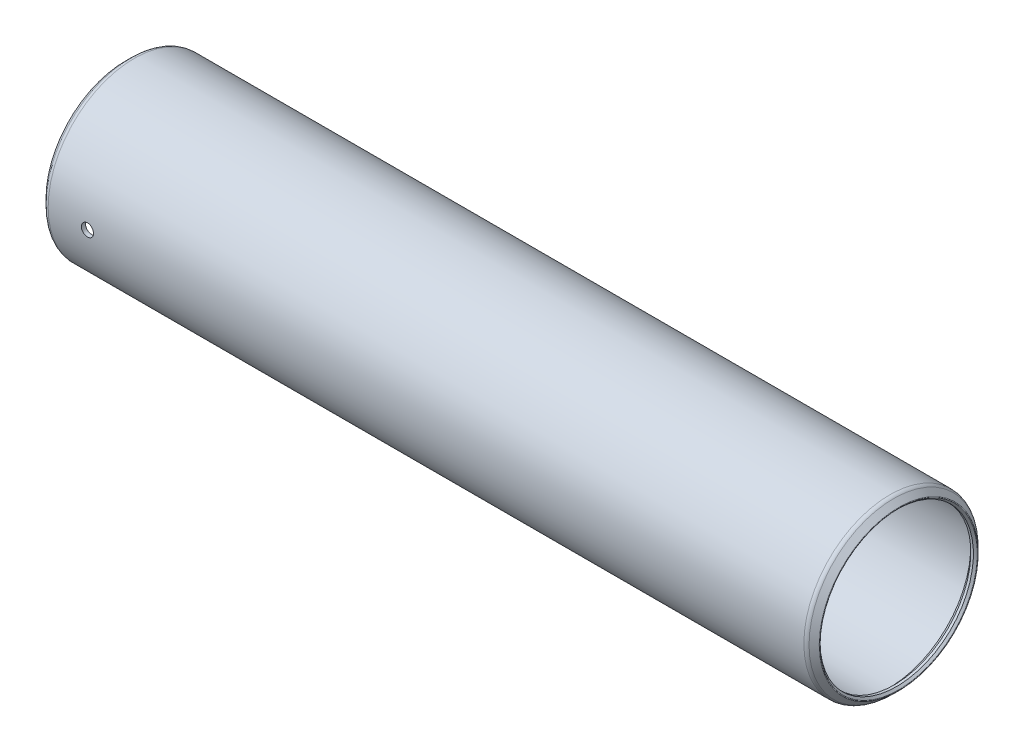
ISO-10303-21;
HEADER;
FILE_DESCRIPTION(('STEP AP214'),'2;1');
FILE_NAME('part.step','',(''),(''),'','','');
FILE_SCHEMA(('AUTOMOTIVE_DESIGN { 1 0 10303 214 1 1 1 1 }'));
ENDSEC;
DATA;
#1=APPLICATION_CONTEXT('core data for automotive mechanical design processes');
#2=APPLICATION_PROTOCOL_DEFINITION('international standard','automotive_design',2000,#1);
#3=PRODUCT_CONTEXT('',#1,'mechanical');
#4=PRODUCT('Part','Part','',(#3));
#5=PRODUCT_RELATED_PRODUCT_CATEGORY('part','',(#4));
#6=PRODUCT_DEFINITION_FORMATION('','',#4);
#7=PRODUCT_DEFINITION_CONTEXT('part definition',#1,'design');
#8=PRODUCT_DEFINITION('design','',#6,#7);
#9=PRODUCT_DEFINITION_SHAPE('','',#8);
#10=(LENGTH_UNIT() NAMED_UNIT(*) SI_UNIT(.MILLI.,.METRE.));
#11=(NAMED_UNIT(*) PLANE_ANGLE_UNIT() SI_UNIT($,.RADIAN.));
#12=(NAMED_UNIT(*) SI_UNIT($,.STERADIAN.) SOLID_ANGLE_UNIT());
#13=UNCERTAINTY_MEASURE_WITH_UNIT(LENGTH_MEASURE(1.E-05),#10,'distance_accuracy_value','');
#14=(GEOMETRIC_REPRESENTATION_CONTEXT(3) GLOBAL_UNCERTAINTY_ASSIGNED_CONTEXT((#13)) GLOBAL_UNIT_ASSIGNED_CONTEXT((#10,
#11,#12)) REPRESENTATION_CONTEXT('',''));
#15=CARTESIAN_POINT('',(0.,0.,0.));
#16=DIRECTION('',(0.,0.,1.));
#17=DIRECTION('',(1.,0.,0.));
#18=AXIS2_PLACEMENT_3D('',#15,#16,#17);
#19=CARTESIAN_POINT('',(149.5552,0.,0.));
#20=DIRECTION('',(-1.,0.,0.));
#21=DIRECTION('',(0.,0.,1.));
#22=AXIS2_PLACEMENT_3D('',#19,#20,#21);
#23=CYLINDRICAL_SURFACE('',#22,16.02105);
#24=CARTESIAN_POINT('',(1.01599999999999,0.,0.));
#25=DIRECTION('',(-1.,0.,0.));
#26=DIRECTION('',(0.,0.,1.));
#27=AXIS2_PLACEMENT_3D('',#24,#25,#26);
#28=CIRCLE('',#27,16.02105);
#29=CARTESIAN_POINT('',(1.01599999999999,0.,16.02105));
#30=VERTEX_POINT('',#29);
#31=EDGE_CURVE('E57',#30,#30,#28,.T.);
#32=ORIENTED_EDGE('',*,*,#31,.T.);
#33=EDGE_LOOP('',(#32));
#34=FACE_BOUND('',#33,.T.);
#35=CARTESIAN_POINT('',(148.5392,0.,0.));
#36=DIRECTION('',(-1.,0.,0.));
#37=DIRECTION('',(0.,0.,1.));
#38=AXIS2_PLACEMENT_3D('',#35,#36,#37);
#39=CIRCLE('',#38,16.02105);
#40=CARTESIAN_POINT('',(148.5392,0.,16.02105));
#41=VERTEX_POINT('',#40);
#42=EDGE_CURVE('E60',#41,#41,#39,.T.);
#43=ORIENTED_EDGE('',*,*,#42,.F.);
#44=EDGE_LOOP('',(#43));
#45=FACE_BOUND('',#44,.T.);
#46=CARTESIAN_POINT('',(9.70279999999999,0.,16.02105));
#47=CARTESIAN_POINT('',(9.70279706520824,-0.0669566152777428,16.0210494133005));
#48=CARTESIAN_POINT('',(9.69714797089088,-0.133959408495349,16.0206257720828));
#49=CARTESIAN_POINT('',(9.67469483321733,-0.266112872885107,16.0189765133516));
#50=CARTESIAN_POINT('',(9.65787799368977,-0.331261329925711,16.0177499758904));
#51=CARTESIAN_POINT('',(9.61357685930651,-0.457772882834231,16.014633597949));
#52=CARTESIAN_POINT('',(9.58609841354014,-0.51913803291572,16.0127441212197));
#53=CARTESIAN_POINT('',(9.52126410536775,-0.636369658290597,16.0085140424356));
#54=CARTESIAN_POINT('',(9.48391042401329,-0.692237344023746,16.0061735400256));
#55=CARTESIAN_POINT('',(9.40030214102438,-0.79701899259515,16.0012988375443));
#56=CARTESIAN_POINT('',(9.35403137567909,-0.845920042926816,15.998764290842));
#57=CARTESIAN_POINT('',(9.25393625477573,-0.935269642121525,15.9937900885991));
#58=CARTESIAN_POINT('',(9.2001115751218,-0.975717828134388,15.9913504371357));
#59=CARTESIAN_POINT('',(9.08636013621567,-1.04705583277077,15.9868383661694));
#60=CARTESIAN_POINT('',(9.02642638212852,-1.07793452726745,15.9847663752428));
#61=CARTESIAN_POINT('',(8.90220696446403,-1.12918591984865,15.9812279272536));
#62=CARTESIAN_POINT('',(8.8379213639444,-1.14955877012468,15.9797614614194));
#63=CARTESIAN_POINT('',(8.70695074157336,-1.17918328521173,15.9776028360577));
#64=CARTESIAN_POINT('',(8.64027043890182,-1.18845570661457,15.9769092315327));
#65=CARTESIAN_POINT('',(8.5062965410256,-1.19568025672226,15.9763702265494));
#66=CARTESIAN_POINT('',(8.43900295525313,-1.1936325592369,15.976524813068));
#67=CARTESIAN_POINT('',(8.30585457888071,-1.1782921804781,15.9776634170375));
#68=CARTESIAN_POINT('',(8.23999717835317,-1.16502201190737,15.9786457739354));
#69=CARTESIAN_POINT('',(8.11144715928859,-1.12764833268643,15.9813266150936));
#70=CARTESIAN_POINT('',(8.04875456621335,-1.10354473489361,15.9830251051143));
#71=CARTESIAN_POINT('',(7.92824175757535,-1.04516304205303,15.9869487342801));
#72=CARTESIAN_POINT('',(7.87042647774632,-1.01087479526701,15.9891743984454));
#73=CARTESIAN_POINT('',(7.76136342516126,-0.933104455322872,15.9939010804274));
#74=CARTESIAN_POINT('',(7.7101157583576,-0.889622213872113,15.996402102685));
#75=CARTESIAN_POINT('',(7.61551172816844,-0.794571676950297,16.001405061793));
#76=CARTESIAN_POINT('',(7.57217492548818,-0.742983909593353,16.0039069859837));
#77=CARTESIAN_POINT('',(7.49477386998589,-0.633254789658335,16.0086239894766));
#78=CARTESIAN_POINT('',(7.46070962185451,-0.575113433765067,16.0108390686336));
#79=CARTESIAN_POINT('',(7.40282205145223,-0.453915229240835,16.0147330951866));
#80=CARTESIAN_POINT('',(7.37899953805438,-0.390857992827259,16.0164120002339));
#81=CARTESIAN_POINT('',(7.34228507708127,-0.261623578508758,16.0190439854347));
#82=CARTESIAN_POINT('',(7.32939294813818,-0.195446452391385,16.0199970776318));
#83=CARTESIAN_POINT('',(7.31492960923661,-0.0620204076045535,16.0210684985366));
#84=CARTESIAN_POINT('',(7.31333136891893,0.00522556567420777,16.0211888203509));
#85=CARTESIAN_POINT('',(7.32143044956756,0.139029521504403,16.0205864563069));
#86=CARTESIAN_POINT('',(7.33112768656339,0.205587509166606,16.0198637767156));
#87=CARTESIAN_POINT('',(7.3615200595147,0.336049510123086,16.0176580024258));
#88=CARTESIAN_POINT('',(7.38220272478208,0.399956444390026,16.016175770041));
#89=CARTESIAN_POINT('',(7.43396614581833,0.523392589080339,16.0126175099669));
#90=CARTESIAN_POINT('',(7.46504703382642,0.582921743817638,16.010541474726));
#91=CARTESIAN_POINT('',(7.5367929603938,0.696035881380302,16.006023610124));
#92=CARTESIAN_POINT('',(7.57747597302289,0.749609435942374,16.0035810979225));
#93=CARTESIAN_POINT('',(7.66724525322349,0.849176400421608,15.9986072063538));
#94=CARTESIAN_POINT('',(7.71633163764561,0.895169704916369,15.9960758257513));
#95=CARTESIAN_POINT('',(7.82163126812709,0.978362781285479,15.9912036531407));
#96=CARTESIAN_POINT('',(7.87785843333551,1.01554496113354,15.9888632484336));
#97=CARTESIAN_POINT('',(7.9957739567659,1.07993983561797,15.9846432199179));
#98=CARTESIAN_POINT('',(8.05746226991206,1.10715261253133,15.9827635923065));
#99=CARTESIAN_POINT('',(8.18448579496939,1.15080601392083,15.97967991949));
#100=CARTESIAN_POINT('',(8.2498172410541,1.16725754600383,15.9784751903857));
#101=CARTESIAN_POINT('',(8.38232441499383,1.18895702368358,15.9768753055686));
#102=CARTESIAN_POINT('',(8.44950011528954,1.1942051366046,15.976480137765));
#103=CARTESIAN_POINT('',(8.58361407368,1.19334702986037,15.976544242776));
#104=CARTESIAN_POINT('',(8.65055251140766,1.18726845700228,15.9770014351036));
#105=CARTESIAN_POINT('',(8.78245520900734,1.16398702720102,15.9787143300673));
#106=CARTESIAN_POINT('',(8.84741946558123,1.14678415167422,15.9799700340373));
#107=CARTESIAN_POINT('',(8.97353251663077,1.10174912009622,15.9831379271101));
#108=CARTESIAN_POINT('',(9.03468143187387,1.07391730068302,15.9850500954212));
#109=CARTESIAN_POINT('',(9.15144291334917,1.00841775259181,15.9893154673754));
#110=CARTESIAN_POINT('',(9.20705559222398,0.970750224091844,15.9916686620422));
#111=CARTESIAN_POINT('',(9.3113070802482,0.886545023273679,15.9965577151813));
#112=CARTESIAN_POINT('',(9.35992945510258,0.839987028367214,15.9990939837127));
#113=CARTESIAN_POINT('',(9.448687277448,0.739356340582741,16.0040597191709));
#114=CARTESIAN_POINT('',(9.48882065829193,0.685281823103509,16.0064891599766));
#115=CARTESIAN_POINT('',(9.55950378441263,0.571068619367323,16.0109710137583));
#116=CARTESIAN_POINT('',(9.59003836690499,0.510920534998868,16.0130228281169));
#117=CARTESIAN_POINT('',(9.64053675717511,0.386378243366696,16.0165108455186));
#118=CARTESIAN_POINT('',(9.66051282111822,0.321989057224918,16.017947761955));
#119=CARTESIAN_POINT('',(9.68419163843129,0.214344538732717,16.019671676354));
#120=CARTESIAN_POINT('',(9.69116061501202,0.171783170918517,16.0201862204269));
#121=CARTESIAN_POINT('',(9.70046573532017,0.0861542420497312,16.0208755706727));
#122=CARTESIAN_POINT('',(9.70280188854287,0.0430866820328002,16.021050377542));
#123=CARTESIAN_POINT('',(9.70279999999999,0.,16.02105));
#124=B_SPLINE_CURVE_WITH_KNOTS('',3,(#46,#47,#48,#49,#50,#51,#52,#53,#54,#55,#56,#57,#58,#59,
#60,#61,#62,#63,#64,#65,#66,#67,#68,#69,#70,#71,#72,#73,#74,#75,#76,#77,#78,#79,#80,#81,#82,#83,
#84,#85,#86,#87,#88,#89,#90,#91,#92,#93,#94,#95,#96,#97,#98,#99,#100,#101,#102,#103,#104,#105,
#106,#107,#108,#109,#110,#111,#112,#113,#114,#115,#116,#117,#118,#119,#120,#121,#122,#123),
.UNSPECIFIED.,.T.,.F.,(4,2,2,2,2,2,2,2,2,2,2,2,2,2,2,2,2,2,2,2,2,2,2,2,2,2,2,2,2,2,2,2,2,2,2,2,
2,2,4),(0.,0.200712542338555,0.401655461870689,0.602488297146018,0.803276813340697,
1.00443277528007,1.20559737032749,1.40699494102528,1.60838959412219,1.80940707000623,
2.01042145946402,2.21103356033869,2.41164727493845,2.61246162989096,2.81327922408424,
3.01458683335453,3.21589454445865,3.41721815154992,3.61853841801394,3.81937668858916,
4.02021346614387,4.22082273899873,4.42143456319521,4.62242493023976,4.82341809232393,
5.02480923250325,5.22619871057404,5.42738374248099,5.62856576964668,5.82925738360845,
6.02994933283515,6.23063492630964,6.43131643571468,6.63246229374364,6.83365706454966,
7.03516807483583,7.23644465768051,7.3656037434647,7.4947625645291),.UNSPECIFIED.);
#125=CARTESIAN_POINT('',(9.70279999999999,0.,16.02105));
#126=VERTEX_POINT('',#125);
#127=EDGE_CURVE('E90',#126,#126,#124,.T.);
#128=ORIENTED_EDGE('',*,*,#127,.F.);
#129=EDGE_LOOP('',(#128));
#130=FACE_BOUND('',#129,.T.);
#131=ADVANCED_FACE('F33',(#34,#45,#130),#23,.F.);
#132=CARTESIAN_POINT('',(149.5552,0.,0.));
#133=DIRECTION('',(-1.,0.,0.));
#134=DIRECTION('',(0.,0.,1.));
#135=AXIS2_PLACEMENT_3D('',#132,#133,#134);
#136=CYLINDRICAL_SURFACE('',#135,16.8465499999996);
#137=CARTESIAN_POINT('',(0.825500000002949,0.,0.));
#138=DIRECTION('',(-1.,0.,0.));
#139=DIRECTION('',(0.,0.,1.));
#140=AXIS2_PLACEMENT_3D('',#137,#138,#139);
#141=CIRCLE('',#140,16.8465499999996);
#142=CARTESIAN_POINT('',(0.825500000002949,0.,16.8465499999996));
#143=VERTEX_POINT('',#142);
#144=EDGE_CURVE('E81',#143,#143,#141,.T.);
#145=ORIENTED_EDGE('',*,*,#144,.F.);
#146=EDGE_LOOP('',(#145));
#147=FACE_BOUND('',#146,.T.);
#148=CARTESIAN_POINT('',(148.729699999988,0.,0.));
#149=DIRECTION('',(-1.,0.,0.));
#150=DIRECTION('',(0.,0.,1.));
#151=AXIS2_PLACEMENT_3D('',#148,#149,#150);
#152=CIRCLE('',#151,16.8465499999997);
#153=CARTESIAN_POINT('',(148.729699999988,0.,16.8465499999997));
#154=VERTEX_POINT('',#153);
#155=EDGE_CURVE('E78',#154,#154,#152,.T.);
#156=ORIENTED_EDGE('',*,*,#155,.T.);
#157=EDGE_LOOP('',(#156));
#158=FACE_BOUND('',#157,.T.);
#159=CARTESIAN_POINT('',(7.3152,0.,16.8465499999996));
#160=CARTESIAN_POINT('',(7.31520293895514,-0.0669661238267227,16.8465494406307));
#161=CARTESIAN_POINT('',(7.32085363115716,-0.133978659531247,16.8461464427668));
#162=CARTESIAN_POINT('',(7.34331348633926,-0.26615199183264,16.8445775491741));
#163=CARTESIAN_POINT('',(7.36013550992843,-0.331310563854439,16.8434107741954));
#164=CARTESIAN_POINT('',(7.40445121840721,-0.457842393718408,16.8404462677168));
#165=CARTESIAN_POINT('',(7.43193912337301,-0.519217680911849,16.8386488780024));
#166=CARTESIAN_POINT('',(7.49679657609811,-0.636467588698453,16.8346250817038));
#167=CARTESIAN_POINT('',(7.53416391576954,-0.692343434611112,16.832398771015));
#168=CARTESIAN_POINT('',(7.61779612843459,-0.797129175059421,16.827762532504));
#169=CARTESIAN_POINT('',(7.66407571961432,-0.846027310366122,16.8253523049829));
#170=CARTESIAN_POINT('',(7.76418801540135,-0.935368874599474,16.8206224207968));
#171=CARTESIAN_POINT('',(7.81802104126684,-0.975811943738018,16.8183027679896));
#172=CARTESIAN_POINT('',(7.93178084589773,-1.04713326343972,16.8140132437029));
#173=CARTESIAN_POINT('',(7.99171393014588,-1.07800148057492,16.8120437400586));
#174=CARTESIAN_POINT('',(8.11592847131427,-1.12923271696379,16.8086805949771));
#175=CARTESIAN_POINT('',(8.18020987047614,-1.14959587572444,16.8072869458925));
#176=CARTESIAN_POINT('',(8.31118085026105,-1.17920562719005,16.8052355890591));
#177=CARTESIAN_POINT('',(8.37786616610815,-1.18847099650881,16.8045766383877));
#178=CARTESIAN_POINT('',(8.51184852816102,-1.19568013971067,16.8040652707627));
#179=CARTESIAN_POINT('',(8.57914556575632,-1.1936240727064,16.8042128424742));
#180=CARTESIAN_POINT('',(8.71231284644801,-1.17826426174688,16.8052967246719));
#181=CARTESIAN_POINT('',(8.77818544998368,-1.16498086772801,16.8062316081159));
#182=CARTESIAN_POINT('',(8.90676365539148,-1.1275750532564,16.8087825219654));
#183=CARTESIAN_POINT('',(8.96946923387477,-1.10345255276871,16.8103985574004));
#184=CARTESIAN_POINT('',(9.08999859804903,-1.04503028840931,16.8141313141687));
#185=CARTESIAN_POINT('',(9.14781791263902,-1.01072133037981,16.8162484874708));
#186=CARTESIAN_POINT('',(9.25688458737119,-0.932906704113812,16.8207445065162));
#187=CARTESIAN_POINT('',(9.30813185184109,-0.889400902019159,16.823123356068));
#188=CARTESIAN_POINT('',(9.40271807563865,-0.794313118975004,16.8278810077325));
#189=CARTESIAN_POINT('',(9.44603933963433,-0.742713533480596,16.8302597981637));
#190=CARTESIAN_POINT('',(9.52340722059522,-0.632964511182586,16.8347442495045));
#191=CARTESIAN_POINT('',(9.55745383337556,-0.574815071423605,16.8368499102908));
#192=CARTESIAN_POINT('',(9.61530460226416,-0.453605972725415,16.8405510845206));
#193=CARTESIAN_POINT('',(9.63910804646987,-0.390545972860742,16.8421465625042));
#194=CARTESIAN_POINT('',(9.67578475724807,-0.261310766180427,16.8446471466386));
#195=CARTESIAN_POINT('',(9.68865818785402,-0.195135606131647,16.8455522631501));
#196=CARTESIAN_POINT('',(9.70308742052837,-0.0617020228476386,16.846568804951));
#197=CARTESIAN_POINT('',(9.7046676793737,0.00555374318701941,16.8466819453528));
#198=CARTESIAN_POINT('',(9.69652967369824,0.139374295202839,16.8461063553156));
#199=CARTESIAN_POINT('',(9.6868114850326,0.205939085820022,16.8454176302602));
#200=CARTESIAN_POINT('',(9.65637270574791,0.336418954054509,16.8433169165544));
#201=CARTESIAN_POINT('',(9.63566337832208,0.400336672111095,16.8419056683635));
#202=CARTESIAN_POINT('',(9.58384164556743,0.523789612436823,16.8385185899685));
#203=CARTESIAN_POINT('',(9.55272912034475,0.583324784188724,16.8365427532576));
#204=CARTESIAN_POINT('',(9.48092219665155,0.696434389011605,16.832244039473));
#205=CARTESIAN_POINT('',(9.44021151239705,0.749998460495226,16.8299205750338));
#206=CARTESIAN_POINT('',(9.35038753591807,0.84954096506295,16.8251899022617));
#207=CARTESIAN_POINT('',(9.30127413789388,0.895519302619714,16.8227826928747));
#208=CARTESIAN_POINT('',(9.19593313972062,0.978668415791489,16.8181508261354));
#209=CARTESIAN_POINT('',(9.1396929718388,1.01582329060936,16.8159265030072));
#210=CARTESIAN_POINT('',(9.02175782215754,1.08016192921223,16.8119166269556));
#211=CARTESIAN_POINT('',(8.96006288173553,1.10734576862492,16.8101310707043));
#212=CARTESIAN_POINT('',(8.8330269050688,1.15094331524486,16.8072025240016));
#213=CARTESIAN_POINT('',(8.76768928295928,1.16736692937402,16.8060589426243));
#214=CARTESIAN_POINT('',(8.63517546433297,1.18901013856214,16.8045416877017));
#215=CARTESIAN_POINT('',(8.56799929230868,1.1942298828015,16.8041680039052));
#216=CARTESIAN_POINT('',(8.43387331669439,1.19331565367433,16.8042329387475));
#217=CARTESIAN_POINT('',(8.36692334046323,1.18720667185156,16.8046697693659));
#218=CARTESIAN_POINT('',(8.2350024798505,1.16386032783146,16.8063027184883));
#219=CARTESIAN_POINT('',(8.17003159887269,1.14662294649599,16.8074988382982));
#220=CARTESIAN_POINT('',(8.04391029763654,1.10151502218121,16.810515131654));
#221=CARTESIAN_POINT('',(7.98275978996443,1.07364472259695,16.8123352909152));
#222=CARTESIAN_POINT('',(7.86600221301046,1.00806521548598,16.8163945594842));
#223=CARTESIAN_POINT('',(7.81039502105466,0.970356225757004,16.8186336595176));
#224=CARTESIAN_POINT('',(7.70617519281369,0.886076476377669,16.8232843181968));
#225=CARTESIAN_POINT('',(7.65757736792871,0.839487420712796,16.8256962263692));
#226=CARTESIAN_POINT('',(7.56887423002009,0.738799018132044,16.8304176242278));
#227=CARTESIAN_POINT('',(7.52877098903372,0.684697844141914,16.8327270888172));
#228=CARTESIAN_POINT('',(7.45815712427103,0.570443887369817,16.8369864063141));
#229=CARTESIAN_POINT('',(7.42766062021841,0.510282366948036,16.8389357281709));
#230=CARTESIAN_POINT('',(7.37723966712562,0.385721784425599,16.8422483990093));
#231=CARTESIAN_POINT('',(7.35730292038865,0.321327750153744,16.8436124292573));
#232=CARTESIAN_POINT('',(7.33371099532527,0.21378734127683,16.8452460392033));
#233=CARTESIAN_POINT('',(7.32677843945678,0.171334871697962,16.8457328320089));
#234=CARTESIAN_POINT('',(7.31752200301421,0.085927971687145,16.8463849915925));
#235=CARTESIAN_POINT('',(7.3151981140119,0.0429735421733137,16.8465503589582));
#236=CARTESIAN_POINT('',(7.3152,0.,16.8465499999996));
#237=B_SPLINE_CURVE_WITH_KNOTS('',3,(#159,#160,#161,#162,#163,#164,#165,#166,#167,#168,#169,
#170,#171,#172,#173,#174,#175,#176,#177,#178,#179,#180,#181,#182,#183,#184,#185,#186,#187,#188,
#189,#190,#191,#192,#193,#194,#195,#196,#197,#198,#199,#200,#201,#202,#203,#204,#205,#206,#207,
#208,#209,#210,#211,#212,#213,#214,#215,#216,#217,#218,#219,#220,#221,#222,#223,#224,#225,#226,
#227,#228,#229,#230,#231,#232,#233,#234,#235,#236),.UNSPECIFIED.,.T.,.F.,(4,2,2,2,2,2,2,2,2,2,2,
2,2,2,2,2,2,2,2,2,2,2,2,2,2,2,2,2,2,2,2,2,2,2,2,2,2,2,4),(0.,0.200741484787577,
0.401714467812576,0.602578693780055,0.803398063793514,1.00455196707638,1.20571442831206,
1.40708697981322,1.60845685702173,1.80948554829892,2.01051141430558,2.21117369310023,
2.41183745359064,2.61268288391973,2.81353123771374,3.01482266839095,3.21611418989387,
3.41741969894465,3.61872218682615,3.81958859649991,4.02045365761123,4.2211132781276,
4.42177521126835,4.62278010175055,4.82378752329926,5.02515447799147,5.22651990533652,
5.42769967434804,5.62887676461845,5.82961057943993,6.03034473947546,6.2310743048392,
6.43179942705711,6.63294267268444,6.83413492572357,7.03562152072881,7.23687294938195,
7.36569313406096,7.49451308315603),.UNSPECIFIED.);
#238=CARTESIAN_POINT('',(7.3152,0.,16.8465499999996));
#239=VERTEX_POINT('',#238);
#240=EDGE_CURVE('E10',#239,#239,#237,.T.);
#241=ORIENTED_EDGE('',*,*,#240,.F.);
#242=EDGE_LOOP('',(#241));
#243=FACE_BOUND('',#242,.T.);
#244=ADVANCED_FACE('F111',(#147,#158,#243),#136,.T.);
#245=CARTESIAN_POINT('',(-0.792815367264614,0.,0.));
#246=DIRECTION('',(-1.,0.,0.));
#247=DIRECTION('',(0.,0.,1.));
#248=AXIS2_PLACEMENT_3D('',#245,#246,#247);
#249=TOROIDAL_SURFACE('',#248,15.4694704896855,0.126999999999535);
#250=CARTESIAN_POINT('',(-0.882617928474827,0.,0.));
#251=DIRECTION('',(-1.,0.,0.));
#252=DIRECTION('',(0.,0.,1.));
#253=AXIS2_PLACEMENT_3D('',#250,#251,#252);
#254=CIRCLE('',#253,15.379667928475);
#255=CARTESIAN_POINT('',(-0.882617928474827,0.,15.379667928475));
#256=VERTEX_POINT('',#255);
#257=EDGE_CURVE('E44',#256,#256,#254,.T.);
#258=ORIENTED_EDGE('',*,*,#257,.F.);
#259=EDGE_LOOP('',(#258));
#260=FACE_BOUND('',#259,.T.);
#261=CARTESIAN_POINT('',(-0.882617928474827,0.,0.));
#262=DIRECTION('',(-1.,0.,0.));
#263=DIRECTION('',(0.,0.,1.));
#264=AXIS2_PLACEMENT_3D('',#261,#262,#263);
#265=CIRCLE('',#264,15.559273050896);
#266=CARTESIAN_POINT('',(-0.882617928474827,0.,15.559273050896));
#267=VERTEX_POINT('',#266);
#268=EDGE_CURVE('E87',#267,#267,#265,.T.);
#269=ORIENTED_EDGE('',*,*,#268,.T.);
#270=EDGE_LOOP('',(#269));
#271=FACE_BOUND('',#270,.T.);
#272=ADVANCED_FACE('F35',(#260,#271),#249,.T.);
#273=CARTESIAN_POINT('',(-0.882617928474827,0.,0.));
#274=DIRECTION('',(-1.,0.,0.));
#275=DIRECTION('',(0.,0.,1.));
#276=AXIS2_PLACEMENT_3D('',#273,#274,#275);
#277=CONICAL_SURFACE('',#276,15.379667928475,0.785398163397689);
#278=CARTESIAN_POINT('',(-0.508000000000008,0.,0.));
#279=DIRECTION('',(-1.,0.,0.));
#280=DIRECTION('',(0.,0.,1.));
#281=AXIS2_PLACEMENT_3D('',#278,#279,#280);
#282=CIRCLE('',#281,15.00505);
#283=CARTESIAN_POINT('',(-0.508000000000008,0.,15.00505));
#284=VERTEX_POINT('',#283);
#285=EDGE_CURVE('E48',#284,#284,#282,.T.);
#286=ORIENTED_EDGE('',*,*,#285,.F.);
#287=EDGE_LOOP('',(#286));
#288=FACE_BOUND('',#287,.T.);
#289=ORIENTED_EDGE('',*,*,#257,.T.);
#290=EDGE_LOOP('',(#289));
#291=FACE_BOUND('',#290,.T.);
#292=ADVANCED_FACE('F160',(#288,#291),#277,.F.);
#293=CARTESIAN_POINT('',(149.5552,0.,0.));
#294=DIRECTION('',(-1.,0.,0.));
#295=DIRECTION('',(0.,0.,1.));
#296=AXIS2_PLACEMENT_3D('',#293,#294,#295);
#297=CYLINDRICAL_SURFACE('',#296,15.00505);
#298=CARTESIAN_POINT('',(0.,0.,0.));
#299=DIRECTION('',(-1.,0.,0.));
#300=DIRECTION('',(0.,0.,1.));
#301=AXIS2_PLACEMENT_3D('',#298,#299,#300);
#302=CIRCLE('',#301,15.00505);
#303=CARTESIAN_POINT('',(0.,0.,15.00505));
#304=VERTEX_POINT('',#303);
#305=EDGE_CURVE('E52',#304,#304,#302,.T.);
#306=ORIENTED_EDGE('',*,*,#305,.F.);
#307=EDGE_LOOP('',(#306));
#308=FACE_BOUND('',#307,.T.);
#309=ORIENTED_EDGE('',*,*,#285,.T.);
#310=EDGE_LOOP('',(#309));
#311=FACE_BOUND('',#310,.T.);
#312=ADVANCED_FACE('F141',(#308,#311),#297,.F.);
#313=CARTESIAN_POINT('',(0.,0.,0.));
#314=DIRECTION('',(1.,0.,0.));
#315=DIRECTION('',(0.,0.,-1.));
#316=AXIS2_PLACEMENT_3D('',#313,#314,#315);
#317=CONICAL_SURFACE('',#316,15.00505,0.785398163397453);
#318=ORIENTED_EDGE('',*,*,#31,.F.);
#319=EDGE_LOOP('',(#318));
#320=FACE_BOUND('',#319,.T.);
#321=ORIENTED_EDGE('',*,*,#305,.T.);
#322=EDGE_LOOP('',(#321));
#323=FACE_BOUND('',#322,.T.);
#324=ADVANCED_FACE('F136',(#320,#323),#317,.F.);
#325=CARTESIAN_POINT('',(148.5392,0.,0.));
#326=DIRECTION('',(-1.,0.,0.));
#327=DIRECTION('',(0.,0.,1.));
#328=AXIS2_PLACEMENT_3D('',#325,#326,#327);
#329=CONICAL_SURFACE('',#328,16.02105,0.785398163397439);
#330=CARTESIAN_POINT('',(149.5552,0.,0.));
#331=DIRECTION('',(-1.,0.,0.));
#332=DIRECTION('',(0.,0.,1.));
#333=AXIS2_PLACEMENT_3D('',#330,#331,#332);
#334=CIRCLE('',#333,15.00505);
#335=CARTESIAN_POINT('',(149.5552,0.,15.00505));
#336=VERTEX_POINT('',#335);
#337=EDGE_CURVE('E63',#336,#336,#334,.T.);
#338=ORIENTED_EDGE('',*,*,#337,.F.);
#339=EDGE_LOOP('',(#338));
#340=FACE_BOUND('',#339,.T.);
#341=ORIENTED_EDGE('',*,*,#42,.T.);
#342=EDGE_LOOP('',(#341));
#343=FACE_BOUND('',#342,.T.);
#344=ADVANCED_FACE('F133',(#340,#343),#329,.F.);
#345=CARTESIAN_POINT('',(149.5552,0.,0.));
#346=DIRECTION('',(-1.,0.,0.));
#347=DIRECTION('',(0.,0.,1.));
#348=AXIS2_PLACEMENT_3D('',#345,#346,#347);
#349=CYLINDRICAL_SURFACE('',#348,15.00505);
#350=CARTESIAN_POINT('',(150.0632,0.,0.));
#351=DIRECTION('',(-1.,0.,0.));
#352=DIRECTION('',(0.,0.,1.));
#353=AXIS2_PLACEMENT_3D('',#350,#351,#352);
#354=CIRCLE('',#353,15.00505);
#355=CARTESIAN_POINT('',(150.0632,0.,15.00505));
#356=VERTEX_POINT('',#355);
#357=EDGE_CURVE('E66',#356,#356,#354,.T.);
#358=ORIENTED_EDGE('',*,*,#357,.F.);
#359=EDGE_LOOP('',(#358));
#360=FACE_BOUND('',#359,.T.);
#361=ORIENTED_EDGE('',*,*,#337,.T.);
#362=EDGE_LOOP('',(#361));
#363=FACE_BOUND('',#362,.T.);
#364=ADVANCED_FACE('F130',(#360,#363),#349,.F.);
#365=CARTESIAN_POINT('',(150.0632,0.,0.));
#366=DIRECTION('',(1.,0.,0.));
#367=DIRECTION('',(0.,0.,-1.));
#368=AXIS2_PLACEMENT_3D('',#365,#366,#367);
#369=CONICAL_SURFACE('',#368,15.00505,0.785398163397442);
#370=CARTESIAN_POINT('',(150.437817928479,0.,0.));
#371=DIRECTION('',(-1.,0.,0.));
#372=DIRECTION('',(0.,0.,1.));
#373=AXIS2_PLACEMENT_3D('',#370,#371,#372);
#374=CIRCLE('',#373,15.3796679284786);
#375=CARTESIAN_POINT('',(150.437817928479,0.,15.3796679284786));
#376=VERTEX_POINT('',#375);
#377=EDGE_CURVE('E69',#376,#376,#374,.T.);
#378=ORIENTED_EDGE('',*,*,#377,.F.);
#379=EDGE_LOOP('',(#378));
#380=FACE_BOUND('',#379,.T.);
#381=ORIENTED_EDGE('',*,*,#357,.T.);
#382=EDGE_LOOP('',(#381));
#383=FACE_BOUND('',#382,.T.);
#384=ADVANCED_FACE('F126',(#380,#383),#369,.F.);
#385=CARTESIAN_POINT('',(150.348015367269,0.,0.));
#386=DIRECTION('',(-1.,0.,0.));
#387=DIRECTION('',(0.,0.,1.));
#388=AXIS2_PLACEMENT_3D('',#385,#386,#387);
#389=TOROIDAL_SURFACE('',#388,15.4694704896879,0.126999999997907);
#390=CARTESIAN_POINT('',(150.437817928479,0.,0.));
#391=DIRECTION('',(-1.,0.,0.));
#392=DIRECTION('',(0.,0.,1.));
#393=AXIS2_PLACEMENT_3D('',#390,#391,#392);
#394=CIRCLE('',#393,15.5592730508971);
#395=CARTESIAN_POINT('',(150.437817928479,0.,15.5592730508971));
#396=VERTEX_POINT('',#395);
#397=EDGE_CURVE('E72',#396,#396,#394,.T.);
#398=ORIENTED_EDGE('',*,*,#397,.F.);
#399=EDGE_LOOP('',(#398));
#400=FACE_BOUND('',#399,.T.);
#401=ORIENTED_EDGE('',*,*,#377,.T.);
#402=EDGE_LOOP('',(#401));
#403=FACE_BOUND('',#402,.T.);
#404=ADVANCED_FACE('F122',(#400,#403),#389,.T.);
#405=CARTESIAN_POINT('',(150.437817928479,0.,0.));
#406=DIRECTION('',(-1.,0.,0.));
#407=DIRECTION('',(0.,0.,1.));
#408=AXIS2_PLACEMENT_3D('',#405,#406,#407);
#409=CONICAL_SURFACE('',#408,15.5592730508971,0.785398163397411);
#410=CARTESIAN_POINT('',(149.448120489703,0.,0.));
#411=DIRECTION('',(-1.,0.,0.));
#412=DIRECTION('',(0.,0.,1.));
#413=AXIS2_PLACEMENT_3D('',#410,#411,#412);
#414=CIRCLE('',#413,16.5489704896729);
#415=CARTESIAN_POINT('',(149.448120489703,0.,16.5489704896729));
#416=VERTEX_POINT('',#415);
#417=EDGE_CURVE('E75',#416,#416,#414,.T.);
#418=ORIENTED_EDGE('',*,*,#417,.F.);
#419=EDGE_LOOP('',(#418));
#420=FACE_BOUND('',#419,.T.);
#421=ORIENTED_EDGE('',*,*,#397,.T.);
#422=EDGE_LOOP('',(#421));
#423=FACE_BOUND('',#422,.T.);
#424=ADVANCED_FACE('F118',(#420,#423),#409,.T.);
#425=CARTESIAN_POINT('',(148.729699999988,0.,0.));
#426=DIRECTION('',(-1.,0.,0.));
#427=DIRECTION('',(0.,0.,1.));
#428=AXIS2_PLACEMENT_3D('',#425,#426,#427);
#429=TOROIDAL_SURFACE('',#428,15.8305499999581,1.01600000004161);
#430=ORIENTED_EDGE('',*,*,#155,.F.);
#431=EDGE_LOOP('',(#430));
#432=FACE_BOUND('',#431,.T.);
#433=ORIENTED_EDGE('',*,*,#417,.T.);
#434=EDGE_LOOP('',(#433));
#435=FACE_BOUND('',#434,.T.);
#436=ADVANCED_FACE('F109',(#432,#435),#429,.T.);
#437=CARTESIAN_POINT('',(0.825500000002616,0.,0.));
#438=DIRECTION('',(-1.,0.,0.));
#439=DIRECTION('',(0.,0.,1.));
#440=AXIS2_PLACEMENT_3D('',#437,#438,#439);
#441=TOROIDAL_SURFACE('',#440,15.8305499999926,1.01600000000701);
#442=CARTESIAN_POINT('',(0.107079510312164,0.,0.));
#443=DIRECTION('',(-1.,0.,0.));
#444=DIRECTION('',(0.,0.,1.));
#445=AXIS2_PLACEMENT_3D('',#442,#443,#444);
#446=CIRCLE('',#445,16.548970489683);
#447=CARTESIAN_POINT('',(0.107079510312164,0.,16.548970489683));
#448=VERTEX_POINT('',#447);
#449=EDGE_CURVE('E84',#448,#448,#446,.T.);
#450=ORIENTED_EDGE('',*,*,#449,.F.);
#451=EDGE_LOOP('',(#450));
#452=FACE_BOUND('',#451,.T.);
#453=ORIENTED_EDGE('',*,*,#144,.T.);
#454=EDGE_LOOP('',(#453));
#455=FACE_BOUND('',#454,.T.);
#456=ADVANCED_FACE('F106',(#452,#455),#441,.T.);
#457=CARTESIAN_POINT('',(0.107079510312164,0.,0.));
#458=DIRECTION('',(1.,0.,0.));
#459=DIRECTION('',(0.,0.,-1.));
#460=AXIS2_PLACEMENT_3D('',#457,#458,#459);
#461=CONICAL_SURFACE('',#460,16.548970489683,0.785398163397458);
#462=ORIENTED_EDGE('',*,*,#268,.F.);
#463=EDGE_LOOP('',(#462));
#464=FACE_BOUND('',#463,.T.);
#465=ORIENTED_EDGE('',*,*,#449,.T.);
#466=EDGE_LOOP('',(#465));
#467=FACE_BOUND('',#466,.T.);
#468=ADVANCED_FACE('F102',(#464,#467),#461,.T.);
#469=CARTESIAN_POINT('',(8.509,0.,16.84655));
#470=DIRECTION('',(0.,0.,-1.));
#471=DIRECTION('',(-1.,0.,0.));
#472=AXIS2_PLACEMENT_3D('',#469,#470,#471);
#473=CYLINDRICAL_SURFACE('',#472,1.1938);
#474=ORIENTED_EDGE('',*,*,#240,.T.);
#475=EDGE_LOOP('',(#474));
#476=FACE_BOUND('',#475,.T.);
#477=ORIENTED_EDGE('',*,*,#127,.T.);
#478=EDGE_LOOP('',(#477));
#479=FACE_BOUND('',#478,.T.);
#480=ADVANCED_FACE('F98',(#476,#479),#473,.F.);
#481=CLOSED_SHELL('',(#131,#244,#272,#292,#312,#324,#344,#364,#384,#404,#424,#436,#456,#468,#480));
#482=MANIFOLD_SOLID_BREP('B2',#481);
#483=ADVANCED_BREP_SHAPE_REPRESENTATION('',(#18,#482),#14);
#484=SHAPE_DEFINITION_REPRESENTATION(#9,#483);
ENDSEC;
END-ISO-10303-21;
